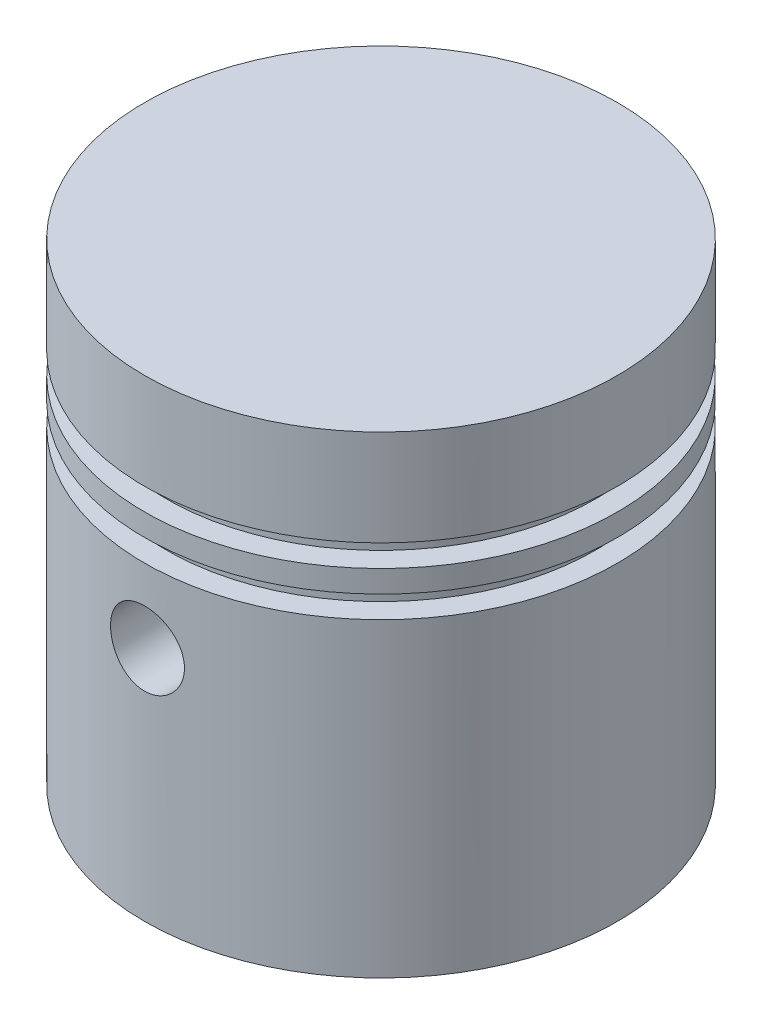
ISO-10303-21;
HEADER;
FILE_DESCRIPTION(('STEP AP214'),'2;1');
FILE_NAME('part.step','',(''),(''),'','','');
FILE_SCHEMA(('AUTOMOTIVE_DESIGN { 1 0 10303 214 1 1 1 1 }'));
ENDSEC;
DATA;
#1=APPLICATION_CONTEXT('core data for automotive mechanical design processes');
#2=APPLICATION_PROTOCOL_DEFINITION('international standard','automotive_design',2000,#1);
#3=PRODUCT_CONTEXT('',#1,'mechanical');
#4=PRODUCT('Part','Part','',(#3));
#5=PRODUCT_RELATED_PRODUCT_CATEGORY('part','',(#4));
#6=PRODUCT_DEFINITION_FORMATION('','',#4);
#7=PRODUCT_DEFINITION_CONTEXT('part definition',#1,'design');
#8=PRODUCT_DEFINITION('design','',#6,#7);
#9=PRODUCT_DEFINITION_SHAPE('','',#8);
#10=(LENGTH_UNIT() NAMED_UNIT(*) SI_UNIT(.MILLI.,.METRE.));
#11=(NAMED_UNIT(*) PLANE_ANGLE_UNIT() SI_UNIT($,.RADIAN.));
#12=(NAMED_UNIT(*) SI_UNIT($,.STERADIAN.) SOLID_ANGLE_UNIT());
#13=UNCERTAINTY_MEASURE_WITH_UNIT(LENGTH_MEASURE(1.E-05),#10,'distance_accuracy_value','');
#14=(GEOMETRIC_REPRESENTATION_CONTEXT(3) GLOBAL_UNCERTAINTY_ASSIGNED_CONTEXT((#13)) GLOBAL_UNIT_ASSIGNED_CONTEXT((#10,
#11,#12)) REPRESENTATION_CONTEXT('',''));
#15=CARTESIAN_POINT('',(0.,0.,0.));
#16=DIRECTION('',(0.,0.,1.));
#17=DIRECTION('',(1.,0.,0.));
#18=AXIS2_PLACEMENT_3D('',#15,#16,#17);
#19=CARTESIAN_POINT('',(0.,16.,0.));
#20=DIRECTION('',(0.,-1.,0.));
#21=DIRECTION('',(0.,0.,-1.));
#22=AXIS2_PLACEMENT_3D('',#19,#20,#21);
#23=CYLINDRICAL_SURFACE('',#22,8.);
#24=CARTESIAN_POINT('',(0.,10.5,0.));
#25=DIRECTION('',(0.,-1.,0.));
#26=DIRECTION('',(0.,0.,-1.));
#27=AXIS2_PLACEMENT_3D('',#24,#25,#26);
#28=CIRCLE('',#27,8.);
#29=CARTESIAN_POINT('',(0.,10.5,-8.));
#30=VERTEX_POINT('',#29);
#31=EDGE_CURVE('E93',#30,#30,#28,.T.);
#32=ORIENTED_EDGE('',*,*,#31,.T.);
#33=EDGE_LOOP('',(#32));
#34=FACE_BOUND('',#33,.T.);
#35=CARTESIAN_POINT('',(0.,9.25,-8.));
#36=CARTESIAN_POINT('',(-0.0697575486355164,9.24999715086424,-7.99999885097242));
#37=CARTESIAN_POINT('',(-0.139554702432852,9.24414094311322,-7.9990780624287));
#38=CARTESIAN_POINT('',(-0.277195657489051,9.22087815436162,-7.99549349048796));
#39=CARTESIAN_POINT('',(-0.345037530661658,9.20346055374825,-7.99282804422361));
#40=CARTESIAN_POINT('',(-0.476756269023702,9.15761016859669,-7.98605348582888));
#41=CARTESIAN_POINT('',(-0.540636176144951,9.1291859593192,-7.98194549781586));
#42=CARTESIAN_POINT('',(-0.662710625522299,9.0621507274292,-7.97273897019077));
#43=CARTESIAN_POINT('',(-0.720905905184154,9.02354102848203,-7.96764055931276));
#44=CARTESIAN_POINT('',(-0.830459955825808,8.93688347582302,-7.95697134207178));
#45=CARTESIAN_POINT('',(-0.881763739571321,8.88876650255488,-7.95139725696168));
#46=CARTESIAN_POINT('',(-0.975603844114116,8.78460902586555,-7.94043038065143));
#47=CARTESIAN_POINT('',(-1.01813964327096,8.7285680513499,-7.93503760025374));
#48=CARTESIAN_POINT('',(-1.09345272164442,8.60978086432814,-7.92501214063723));
#49=CARTESIAN_POINT('',(-1.12617636778996,8.5470002588191,-7.92038369893052));
#50=CARTESIAN_POINT('',(-1.18059340798533,8.4167492945711,-7.91245600871182));
#51=CARTESIAN_POINT('',(-1.20228745505032,8.34927921374472,-7.90915668151108));
#52=CARTESIAN_POINT('',(-1.23385779661084,8.21214454942811,-7.90429317255518));
#53=CARTESIAN_POINT('',(-1.24382852743748,8.1425022070906,-7.90271513266182));
#54=CARTESIAN_POINT('',(-1.25196184878811,8.00251640555368,-7.90143085535887));
#55=CARTESIAN_POINT('',(-1.25012517430233,7.93217299026698,-7.90172450144011));
#56=CARTESIAN_POINT('',(-1.23477290404445,7.79345148407366,-7.90413775227603));
#57=CARTESIAN_POINT('',(-1.22136281479847,7.72506138832343,-7.90624086092473));
#58=CARTESIAN_POINT('',(-1.18340968916876,7.59151399682034,-7.91201028172736));
#59=CARTESIAN_POINT('',(-1.15886631342066,7.52635679967973,-7.91567664153206));
#60=CARTESIAN_POINT('',(-1.09923458474692,7.40080564366142,-7.92417753427311));
#61=CARTESIAN_POINT('',(-1.06410186157774,7.34043310411347,-7.92901696543622));
#62=CARTESIAN_POINT('',(-0.984320290733186,7.22640023215723,-7.93931523075049));
#63=CARTESIAN_POINT('',(-0.939670766265083,7.17274037755627,-7.94477410894106));
#64=CARTESIAN_POINT('',(-0.841545444111664,7.07304487668334,-7.95576893124448));
#65=CARTESIAN_POINT('',(-0.787979002802695,7.02709842086527,-7.96130506817796));
#66=CARTESIAN_POINT('',(-0.67384847368968,6.94483342718005,-7.97177562673913));
#67=CARTESIAN_POINT('',(-0.613284350340659,6.90851493822159,-7.97671004531012));
#68=CARTESIAN_POINT('',(-0.486797963528246,6.8465309632888,-7.98542699513518));
#69=CARTESIAN_POINT('',(-0.420872093120231,6.8208727207335,-7.98920874270967));
#70=CARTESIAN_POINT('',(-0.28557476734838,6.78101701627639,-7.99518780000339));
#71=CARTESIAN_POINT('',(-0.2162035653436,6.76681871296676,-7.99738522604488));
#72=CARTESIAN_POINT('',(-0.076754168381868,6.7504053617749,-7.99993255863639));
#73=CARTESIAN_POINT('',(-0.00669073075435153,6.74806776051191,-8.0003013589643));
#74=CARTESIAN_POINT('',(0.13282727320582,6.75511635266799,-7.99920143245634));
#75=CARTESIAN_POINT('',(0.202281859962577,6.76450215129455,-7.99773276749821));
#76=CARTESIAN_POINT('',(0.338236723132852,6.79462919384009,-7.99313461846611));
#77=CARTESIAN_POINT('',(0.404750631028021,6.81531037913387,-7.99001392107693));
#78=CARTESIAN_POINT('',(0.533367033928313,6.86737754719939,-7.98246037841779));
#79=CARTESIAN_POINT('',(0.595469306519703,6.89876406922134,-7.97802746705036));
#80=CARTESIAN_POINT('',(0.714036101125204,6.97163599556329,-7.96829486370472));
#81=CARTESIAN_POINT('',(0.770452561891863,7.01319871004524,-7.9629886433171));
#82=CARTESIAN_POINT('',(0.875553482539031,7.10513604295389,-7.95211940232218));
#83=CARTESIAN_POINT('',(0.924237452235089,7.15551121960243,-7.94655636546338));
#84=CARTESIAN_POINT('',(1.01294040388345,7.2641905986086,-7.93574013768325));
#85=CARTESIAN_POINT('',(1.05287699292063,7.32256242356116,-7.93049020595401));
#86=CARTESIAN_POINT('',(1.1223778386332,7.44525803683067,-7.92095346402914));
#87=CARTESIAN_POINT('',(1.15194239389052,7.50958165374474,-7.91666662610998));
#88=CARTESIAN_POINT('',(1.19973385972497,7.64211482035709,-7.90956535676178));
#89=CARTESIAN_POINT('',(1.21800327473956,7.71030873438281,-7.9067454117448));
#90=CARTESIAN_POINT('',(1.24282061020268,7.84884457183199,-7.90288285140397));
#91=CARTESIAN_POINT('',(1.24936941542499,7.9191863327095,-7.9018401019222));
#92=CARTESIAN_POINT('',(1.25053726345378,8.05919935795374,-7.90165529022442));
#93=CARTESIAN_POINT('',(1.24528590274213,8.12886954846675,-7.90249258021451));
#94=CARTESIAN_POINT('',(1.2232811162795,8.26632264857215,-7.90592849470915));
#95=CARTESIAN_POINT('',(1.20652771543481,8.33410556225086,-7.90852711539975));
#96=CARTESIAN_POINT('',(1.16204164945926,8.46581891332026,-7.91518544427453));
#97=CARTESIAN_POINT('',(1.1343188086929,8.52975273912921,-7.91924384476704));
#98=CARTESIAN_POINT('',(1.06869384273209,8.65208280683814,-7.92836592023698));
#99=CARTESIAN_POINT('',(1.03079131410443,8.71047882914422,-7.93342963505413));
#100=CARTESIAN_POINT('',(0.945415040695399,8.82073277206341,-7.9440578404613));
#101=CARTESIAN_POINT('',(0.897845535473842,8.87251609830692,-7.94962700580145));
#102=CARTESIAN_POINT('',(0.794687973191021,8.96741061819337,-7.96060021820367));
#103=CARTESIAN_POINT('',(0.739098060392163,9.01051979929594,-7.96600422670061));
#104=CARTESIAN_POINT('',(0.621083429421708,9.08707561151578,-7.9760755122835));
#105=CARTESIAN_POINT('',(0.558619686071192,9.12046268637981,-7.98073817215134));
#106=CARTESIAN_POINT('',(0.428925941178893,9.17622049809647,-7.9887562991944));
#107=CARTESIAN_POINT('',(0.361700888290882,9.19860248627919,-7.9921131007106));
#108=CARTESIAN_POINT('',(0.245157119955798,9.22671651054529,-7.9963872293244));
#109=CARTESIAN_POINT('',(0.196552787825813,9.2354342453145,-7.99773495813061));
#110=CARTESIAN_POINT('',(0.098638898925291,9.24707695668954,-7.99954174348811));
#111=CARTESIAN_POINT('',(0.0493293520845593,9.25000201477867,-8.00000081253982));
#112=CARTESIAN_POINT('',(0.,9.25,-8.));
#113=B_SPLINE_CURVE_WITH_KNOTS('',3,(#35,#36,#37,#38,#39,#40,#41,#42,#43,#44,#45,#46,#47,#48,
#49,#50,#51,#52,#53,#54,#55,#56,#57,#58,#59,#60,#61,#62,#63,#64,#65,#66,#67,#68,#69,#70,#71,#72,
#73,#74,#75,#76,#77,#78,#79,#80,#81,#82,#83,#84,#85,#86,#87,#88,#89,#90,#91,#92,#93,#94,#95,#96,
#97,#98,#99,#100,#101,#102,#103,#104,#105,#106,#107,#108,#109,#110,#111,#112),.UNSPECIFIED.,.T.,
.F.,(4,2,2,2,2,2,2,2,2,2,2,2,2,2,2,2,2,2,2,2,2,2,2,2,2,2,2,2,2,2,2,2,2,2,2,2,2,2,4),(0.,
0.209092370238745,0.418384321264007,0.627513539720513,0.836615593960149,1.04729784076099,
1.25799261822711,1.46981889302879,1.68163262504619,1.89172815567497,2.10181060835273,
2.3099978801129,2.51819149825525,2.72726988701174,2.93636314946034,3.14772866167183,
3.35909524756913,3.57060521877282,3.78209965914933,3.99140427002957,4.20070183264178,
4.40889722378283,4.61710310371015,4.82694270734836,5.03679560800708,5.24854740124795,
5.4602930982449,5.67123705197565,5.88216508114648,6.09078790799346,6.29941028309448,
6.50784623483309,6.71629044835674,6.9269100615777,7.1375784857115,7.34951152099921,
7.5612274282814,7.7090900817577,7.85695065529354),.UNSPECIFIED.);
#114=CARTESIAN_POINT('',(0.,9.25,-8.));
#115=VERTEX_POINT('',#114);
#116=EDGE_CURVE('E92',#115,#115,#113,.T.);
#117=ORIENTED_EDGE('',*,*,#116,.T.);
#118=EDGE_LOOP('',(#117));
#119=FACE_BOUND('',#118,.T.);
#120=CARTESIAN_POINT('',(1.25,8.,7.90174031463955));
#121=CARTESIAN_POINT('',(1.24999714589602,7.93024831083641,7.90174151747695));
#122=CARTESIAN_POINT('',(1.24414188871431,7.86045700117776,7.90267390208986));
#123=CARTESIAN_POINT('',(1.2208832182291,7.72282818551743,7.90629985526833));
#124=CARTESIAN_POINT('',(1.20346876400912,7.65499261226406,7.90899510762377));
#125=CARTESIAN_POINT('',(1.15762758023421,7.52328720517116,7.91583424559868));
#126=CARTESIAN_POINT('',(1.12920957460922,7.45941427606284,7.919976983357));
#127=CARTESIAN_POINT('',(1.06218895908233,7.33735155458073,7.92924294913634));
#128=CARTESIAN_POINT('',(1.02358765802571,7.27916103317071,7.93436605112924));
#129=CARTESIAN_POINT('',(0.936938650554447,7.16960175742388,7.94506519257156));
#130=CARTESIAN_POINT('',(0.888819943087469,7.11828946280005,7.95064443921898));
#131=CARTESIAN_POINT('',(0.784655404938386,7.02443288978516,7.96159865413737));
#132=CARTESIAN_POINT('',(0.728609126584249,6.98188910688789,7.96697361085027));
#133=CARTESIAN_POINT('',(0.609817145928798,6.90656756147939,7.97694733576469));
#134=CARTESIAN_POINT('',(0.547037963178642,6.87384199801276,7.98154190081689));
#135=CARTESIAN_POINT('',(0.416790085897379,6.81942102263747,7.98940157455279));
#136=CARTESIAN_POINT('',(0.349321660068405,6.79772497930867,7.99266675933898));
#137=CARTESIAN_POINT('',(0.212192662724404,6.76615064052192,7.99747714289859));
#138=CARTESIAN_POINT('',(0.142554380080375,6.75617767546582,7.99903611302523));
#139=CARTESIAN_POINT('',(0.00257657177533495,6.74803847834832,8.00030565490477));
#140=CARTESIAN_POINT('',(-0.0677629114945939,6.74987153682408,8.00001633772735));
#141=CARTESIAN_POINT('',(-0.206500044861076,6.76521796313893,7.99763286949342));
#142=CARTESIAN_POINT('',(-0.274909271287588,6.77862946942016,7.99555445847991));
#143=CARTESIAN_POINT('',(-0.408494187671746,6.81659201431131,7.98984386977642));
#144=CARTESIAN_POINT('',(-0.473669788676088,6.84114335917707,7.98621164936935));
#145=CARTESIAN_POINT('',(-0.599243713396236,6.90079182793003,7.97777459210141));
#146=CARTESIAN_POINT('',(-0.659621495359185,6.93593150271398,7.97296503885208));
#147=CARTESIAN_POINT('',(-0.773661928266066,7.01572804031462,7.96270873510231));
#148=CARTESIAN_POINT('',(-0.827324099796619,7.06038558197749,7.95726193916408));
#149=CARTESIAN_POINT('',(-0.927010992600116,7.15851674353663,7.94626939127781));
#150=CARTESIAN_POINT('',(-0.972948128065373,7.21207933319743,7.94072320355105));
#151=CARTESIAN_POINT('',(-1.05519613023743,7.32619878234107,7.93021346922373));
#152=CARTESIAN_POINT('',(-1.09150692769168,7.38675569213703,7.92524992681491));
#153=CARTESIAN_POINT('',(-1.15348530317843,7.5132398140529,7.91646746408067));
#154=CARTESIAN_POINT('',(-1.1791433194208,7.57917178753673,7.91264957292446));
#155=CARTESIAN_POINT('',(-1.21899671563834,7.71448242435274,7.9066084495474));
#156=CARTESIAN_POINT('',(-1.23319297597629,7.78386082253486,7.90438509485371));
#157=CARTESIAN_POINT('',(-1.24959859618928,7.92331405163761,7.90180818484429));
#158=CARTESIAN_POINT('',(-1.25193236705635,7.99337390009738,7.90143522402998));
#159=CARTESIAN_POINT('',(-1.24487739516592,8.13288381764895,7.9025497488591));
#160=CARTESIAN_POINT('',(-1.23548904827164,8.20233390725293,7.90403717167621));
#161=CARTESIAN_POINT('',(-1.20536206277948,8.33826390373324,7.90868700525928));
#162=CARTESIAN_POINT('',(-1.18468589390989,8.4047579993198,7.91184019416676));
#163=CARTESIAN_POINT('',(-1.13263536120966,8.53333698555194,7.91945862198424));
#164=CARTESIAN_POINT('',(-1.10126042801475,8.59542164132451,7.92392393072055));
#165=CARTESIAN_POINT('',(-1.02840599585147,8.71397564082441,7.93370896103555));
#166=CARTESIAN_POINT('',(-0.986846255467355,8.77039511444998,7.93903534729881));
#167=CARTESIAN_POINT('',(-0.894912969976413,8.8755034904241,7.94992252348104));
#168=CARTESIAN_POINT('',(-0.844538882607102,8.92419191680352,7.95548332780552));
#169=CARTESIAN_POINT('',(-0.73585773382904,9.01290563531773,7.96627369437276));
#170=CARTESIAN_POINT('',(-0.677482820794917,9.05284828821503,7.97149979210822));
#171=CARTESIAN_POINT('',(-0.554779305146685,9.12235975999512,7.98097744670418));
#172=CARTESIAN_POINT('',(-0.490450876581244,9.15192888202297,7.98522903204154));
#173=CARTESIAN_POINT('',(-0.357919831889161,9.19972313764208,7.99226348838417));
#174=CARTESIAN_POINT('',(-0.289733573808541,9.2179927487197,7.9950521112786));
#175=CARTESIAN_POINT('',(-0.151213974885371,9.24281306633641,7.99887064894726));
#176=CARTESIAN_POINT('',(-0.0808807888272152,9.24936461567798,7.99990069020438));
#177=CARTESIAN_POINT('',(0.0591360825941384,9.25054092632761,8.00008455063986));
#178=CARTESIAN_POINT('',(0.128818714429901,9.24529187232137,7.99925822019994));
#179=CARTESIAN_POINT('',(0.266297297732436,9.22328734190984,7.9958623900713));
#180=CARTESIAN_POINT('',(0.334093256790798,9.20653191181083,7.99329289739778));
#181=CARTESIAN_POINT('',(0.465834425214725,9.16203637014377,7.98669820710743));
#182=CARTESIAN_POINT('',(0.529782898258215,9.13430572420936,7.98267426414775));
#183=CARTESIAN_POINT('',(0.652139036266007,9.06866058073917,7.97361166155728));
#184=CARTESIAN_POINT('',(0.710546490726961,9.03074569651356,7.96857296339862));
#185=CARTESIAN_POINT('',(0.820801095929352,8.94535527839514,7.9579764111196));
#186=CARTESIAN_POINT('',(0.872575847413248,8.89778684284548,7.95241381770964));
#187=CARTESIAN_POINT('',(0.96745356368349,8.7946350213348,7.94143064388637));
#188=CARTESIAN_POINT('',(1.01055449281041,8.739049759147,7.936010097069));
#189=CARTESIAN_POINT('',(1.08710075771188,8.62103944785431,7.92588898732018));
#190=CARTESIAN_POINT('',(1.12048522074144,8.55857452066291,7.92119304654734));
#191=CARTESIAN_POINT('',(1.17623782803743,8.42887839115245,7.91310716729583));
#192=CARTESIAN_POINT('',(1.19861725029602,8.36165214943308,7.90971589257156));
#193=CARTESIAN_POINT('',(1.22672453478634,8.24511513015645,7.90539548341694));
#194=CARTESIAN_POINT('',(1.23543924637686,8.19651920000936,7.90403218990729));
#195=CARTESIAN_POINT('',(1.24707794539411,8.09862210947502,7.90220418687746));
#196=CARTESIAN_POINT('',(1.25000201811811,8.04932095948656,7.90173946412116));
#197=CARTESIAN_POINT('',(1.25,8.,7.90174031463955));
#198=B_SPLINE_CURVE_WITH_KNOTS('',3,(#120,#121,#122,#123,#124,#125,#126,#127,#128,#129,#130,
#131,#132,#133,#134,#135,#136,#137,#138,#139,#140,#141,#142,#143,#144,#145,#146,#147,#148,#149,
#150,#151,#152,#153,#154,#155,#156,#157,#158,#159,#160,#161,#162,#163,#164,#165,#166,#167,#168,
#169,#170,#171,#172,#173,#174,#175,#176,#177,#178,#179,#180,#181,#182,#183,#184,#185,#186,#187,
#188,#189,#190,#191,#192,#193,#194,#195,#196,#197),.UNSPECIFIED.,.T.,.F.,(4,2,2,2,2,2,2,2,2,2,2,
2,2,2,2,2,2,2,2,2,2,2,2,2,2,2,2,2,2,2,2,2,2,2,2,2,2,2,4),(0.,0.209074763941293,0.41834951626796,
0.627458688206188,0.836540996707036,1.04724629023635,1.25796348710333,1.4697818900924,
1.68158816549379,1.89167198756851,2.10174318513255,2.30998489573485,2.5182323316538,
2.72732806463509,2.93643871601874,3.14778021695736,3.3591232382602,3.57065555017417,
3.78217161301618,3.99146470015321,4.20075071952324,4.40889006724113,4.61704049339771,
4.82688676416582,5.03674594931015,5.24850985997734,5.46026758176487,5.67118638114213,
5.88209000991818,6.09074917034593,6.29940749105005,6.50788624405681,6.71637291400441,
6.92697020198998,7.1376168575629,7.34955610829278,7.56127770816942,7.70911527287132,
7.85695065988004),.UNSPECIFIED.);
#199=CARTESIAN_POINT('',(1.25,8.,7.90174031463955));
#200=VERTEX_POINT('',#199);
#201=EDGE_CURVE('E86',#200,#200,#198,.T.);
#202=ORIENTED_EDGE('',*,*,#201,.T.);
#203=EDGE_LOOP('',(#202));
#204=FACE_BOUND('',#203,.T.);
#205=CARTESIAN_POINT('',(0.,0.,0.));
#206=DIRECTION('',(0.,1.,0.));
#207=DIRECTION('',(0.,0.,1.));
#208=AXIS2_PLACEMENT_3D('',#205,#206,#207);
#209=CIRCLE('',#208,8.);
#210=CARTESIAN_POINT('',(0.,0.,8.));
#211=VERTEX_POINT('',#210);
#212=EDGE_CURVE('E47',#211,#211,#209,.T.);
#213=ORIENTED_EDGE('',*,*,#212,.T.);
#214=EDGE_LOOP('',(#213));
#215=FACE_BOUND('',#214,.T.);
#216=ADVANCED_FACE('F34',(#34,#119,#204,#215),#23,.T.);
#217=CARTESIAN_POINT('',(0.,0.,0.));
#218=DIRECTION('',(0.,1.,0.));
#219=DIRECTION('',(0.,0.,1.));
#220=AXIS2_PLACEMENT_3D('',#217,#218,#219);
#221=PLANE('',#220);
#222=CARTESIAN_POINT('',(0.,0.,0.));
#223=DIRECTION('',(0.,-1.,0.));
#224=DIRECTION('',(0.,0.,-1.));
#225=AXIS2_PLACEMENT_3D('',#222,#223,#224);
#226=CIRCLE('',#225,6.5);
#227=CARTESIAN_POINT('',(0.,0.,-6.5));
#228=VERTEX_POINT('',#227);
#229=EDGE_CURVE('E55',#228,#228,#226,.T.);
#230=ORIENTED_EDGE('',*,*,#229,.F.);
#231=EDGE_LOOP('',(#230));
#232=FACE_BOUND('',#231,.T.);
#233=ORIENTED_EDGE('',*,*,#212,.F.);
#234=EDGE_LOOP('',(#233));
#235=FACE_BOUND('',#234,.T.);
#236=ADVANCED_FACE('F109',(#232,#235),#221,.F.);
#237=CARTESIAN_POINT('',(0.,5.,0.));
#238=DIRECTION('',(0.,-1.,0.));
#239=DIRECTION('',(0.,0.,-1.));
#240=AXIS2_PLACEMENT_3D('',#237,#238,#239);
#241=CYLINDRICAL_SURFACE('',#240,6.5);
#242=CARTESIAN_POINT('',(0.,5.,0.));
#243=DIRECTION('',(0.,-1.,0.));
#244=DIRECTION('',(0.,0.,-1.));
#245=AXIS2_PLACEMENT_3D('',#242,#243,#244);
#246=CIRCLE('',#245,6.5);
#247=CARTESIAN_POINT('',(0.,5.,-6.5));
#248=VERTEX_POINT('',#247);
#249=EDGE_CURVE('E52',#248,#248,#246,.T.);
#250=ORIENTED_EDGE('',*,*,#249,.F.);
#251=EDGE_LOOP('',(#250));
#252=FACE_BOUND('',#251,.T.);
#253=ORIENTED_EDGE('',*,*,#229,.T.);
#254=EDGE_LOOP('',(#253));
#255=FACE_BOUND('',#254,.T.);
#256=ADVANCED_FACE('F107',(#252,#255),#241,.F.);
#257=CARTESIAN_POINT('',(0.,5.,0.));
#258=DIRECTION('',(0.,-1.,0.));
#259=DIRECTION('',(0.,0.,-1.));
#260=AXIS2_PLACEMENT_3D('',#257,#258,#259);
#261=PLANE('',#260);
#262=CARTESIAN_POINT('',(0.,5.,0.));
#263=DIRECTION('',(0.,-1.,0.));
#264=DIRECTION('',(0.,0.,-1.));
#265=AXIS2_PLACEMENT_3D('',#262,#263,#264);
#266=CIRCLE('',#265,5.);
#267=CARTESIAN_POINT('',(0.,5.,-5.));
#268=VERTEX_POINT('',#267);
#269=EDGE_CURVE('E58',#268,#268,#266,.T.);
#270=ORIENTED_EDGE('',*,*,#269,.F.);
#271=EDGE_LOOP('',(#270));
#272=FACE_BOUND('',#271,.T.);
#273=ORIENTED_EDGE('',*,*,#249,.T.);
#274=EDGE_LOOP('',(#273));
#275=FACE_BOUND('',#274,.T.);
#276=ADVANCED_FACE('F246',(#272,#275),#261,.T.);
#277=CARTESIAN_POINT('',(0.,12.,0.));
#278=DIRECTION('',(0.,-1.,0.));
#279=DIRECTION('',(0.,0.,-1.));
#280=AXIS2_PLACEMENT_3D('',#277,#278,#279);
#281=CYLINDRICAL_SURFACE('',#280,5.);
#282=CARTESIAN_POINT('',(0.,9.25,-5.));
#283=CARTESIAN_POINT('',(0.0690634072247759,9.24999806188487,-4.99999883223344));
#284=CARTESIAN_POINT('',(0.138148464858969,9.24425704102184,-4.99855481776523));
#285=CARTESIAN_POINT('',(0.27433860314211,9.2214790405775,-4.99293428191577));
#286=CARTESIAN_POINT('',(0.341442539058949,9.20443565871846,-4.98875621183307));
#287=CARTESIAN_POINT('',(0.471684060152148,9.15963395544826,-4.97813021943366));
#288=CARTESIAN_POINT('',(0.534826302858336,9.1318885010706,-4.97168502368406));
#289=CARTESIAN_POINT('',(0.655560109920356,9.06651550829597,-4.95721119839661));
#290=CARTESIAN_POINT('',(0.7131514869573,9.02888763656755,-4.94918251545042));
#291=CARTESIAN_POINT('',(0.822334939417433,8.94399934195483,-4.93222844659834));
#292=CARTESIAN_POINT('',(0.873796408384227,8.89657368753402,-4.92328922623777));
#293=CARTESIAN_POINT('',(0.968124106002753,8.79378982924257,-4.90561350097941));
#294=CARTESIAN_POINT('',(1.01098936412428,8.73843073087792,-4.89687701906957));
#295=CARTESIAN_POINT('',(1.08752211899919,8.62033731105214,-4.88045646416425));
#296=CARTESIAN_POINT('',(1.12104351327113,8.55750564099133,-4.87278995392171));
#297=CARTESIAN_POINT('',(1.17699742379211,8.42687632361803,-4.85957912343519));
#298=CARTESIAN_POINT('',(1.19943171286611,8.35907947222853,-4.85403446393991));
#299=CARTESIAN_POINT('',(1.23212903067024,8.2218804181646,-4.84583730597959));
#300=CARTESIAN_POINT('',(1.24262689027778,8.15253758662517,-4.84312909229522));
#301=CARTESIAN_POINT('',(1.25188481255654,8.01302619248834,-4.84074468781451));
#302=CARTESIAN_POINT('',(1.25064678484831,7.94285776608449,-4.8410680037387));
#303=CARTESIAN_POINT('',(1.2366554371994,7.8054868268796,-4.84466004580515));
#304=CARTESIAN_POINT('',(1.22418195015877,7.73825364877908,-4.84785719168233));
#305=CARTESIAN_POINT('',(1.18852015575259,7.60686579090726,-4.85672258063736));
#306=CARTESIAN_POINT('',(1.16533108505785,7.54271133080918,-4.8623909997558));
#307=CARTESIAN_POINT('',(1.10865789828096,7.41855165312328,-4.87562594920155));
#308=CARTESIAN_POINT('',(1.07507222269409,7.35859485684204,-4.88321106224518));
#309=CARTESIAN_POINT('',(0.998630230012462,7.2450677418693,-4.89941425705322));
#310=CARTESIAN_POINT('',(0.955772290674033,7.19149854327729,-4.90803251945613));
#311=CARTESIAN_POINT('',(0.860552853901015,7.090663653588,-4.92563233783151));
#312=CARTESIAN_POINT('',(0.807955215138217,7.04362125828221,-4.93461724564976));
#313=CARTESIAN_POINT('',(0.695509931253083,6.95898229794675,-4.95171637982321));
#314=CARTESIAN_POINT('',(0.63566206475662,6.92138602144703,-4.95983057957846));
#315=CARTESIAN_POINT('',(0.51009657390116,6.85662451147968,-4.97431443411819));
#316=CARTESIAN_POINT('',(0.44435949434052,6.82949554978798,-4.98067800106438));
#317=CARTESIAN_POINT('',(0.309063340119069,6.78673557857536,-4.99089930826182));
#318=CARTESIAN_POINT('',(0.239504999292071,6.77110236965155,-4.99475752782734));
#319=CARTESIAN_POINT('',(0.100449975325023,6.75211869536764,-4.99946249392812));
#320=CARTESIAN_POINT('',(0.0309972666568417,6.74846414493725,-5.00038377923565));
#321=CARTESIAN_POINT('',(-0.107527395667923,6.75270750171291,-4.99932337345376));
#322=CARTESIAN_POINT('',(-0.176599383037162,6.76060436899928,-4.99734194368205));
#323=CARTESIAN_POINT('',(-0.311345223980409,6.78747575699282,-4.99074650939464));
#324=CARTESIAN_POINT('',(-0.377054265807295,6.80628438623082,-4.98617195154843));
#325=CARTESIAN_POINT('',(-0.504381077043759,6.85425590335704,-4.97490588861778));
#326=CARTESIAN_POINT('',(-0.565998432527195,6.88341983692764,-4.9682141697491));
#327=CARTESIAN_POINT('',(-0.684602612024873,6.95186344072894,-4.95327756605259));
#328=CARTESIAN_POINT('',(-0.741487868196525,6.9913134269973,-4.94500722805777));
#329=CARTESIAN_POINT('',(-0.847938844702705,7.07899159066414,-4.92787090989516));
#330=CARTESIAN_POINT('',(-0.897503299144173,7.12722128301409,-4.91900482709754));
#331=CARTESIAN_POINT('',(-0.989158806727275,7.23250163403705,-4.90140797467309));
#332=CARTESIAN_POINT('',(-1.03103655635169,7.28973975250202,-4.89268586822734));
#333=CARTESIAN_POINT('',(-1.10459229917725,7.41061052872143,-4.87660731981032));
#334=CARTESIAN_POINT('',(-1.13627074513161,7.47424290246646,-4.86925081722522));
#335=CARTESIAN_POINT('',(-1.18829285050774,7.60575476867757,-4.85681745612221));
#336=CARTESIAN_POINT('',(-1.20870366387839,7.67360635695334,-4.85172712743255));
#337=CARTESIAN_POINT('',(-1.23778804996148,7.81192469824092,-4.84438953408486));
#338=CARTESIAN_POINT('',(-1.24646418956555,7.88239087586041,-4.84214164766613));
#339=CARTESIAN_POINT('',(-1.25169882527833,8.02176751987934,-4.84079084336631));
#340=CARTESIAN_POINT('',(-1.2485982481501,8.09066452927061,-4.8415994394022));
#341=CARTESIAN_POINT('',(-1.23114773192739,8.22691990722332,-4.84606590839869));
#342=CARTESIAN_POINT('',(-1.21679801890564,8.29427830667804,-4.84972372409881));
#343=CARTESIAN_POINT('',(-1.17744276620233,8.42517371588784,-4.85942717235602));
#344=CARTESIAN_POINT('',(-1.15250117056698,8.48873108770017,-4.86545846030258));
#345=CARTESIAN_POINT('',(-1.09272076133756,8.61080448559474,-4.8792312977069));
#346=CARTESIAN_POINT('',(-1.05788057502849,8.6693198109891,-4.88697308433977));
#347=CARTESIAN_POINT('',(-0.97822312386428,8.78129552416835,-4.90354695219593));
#348=CARTESIAN_POINT('',(-0.933169302426878,8.8345842278533,-4.91240220693131));
#349=CARTESIAN_POINT('',(-0.834824475991445,8.93295587066284,-4.93006689371905));
#350=CARTESIAN_POINT('',(-0.781531517717621,8.97803685842747,-4.93887631439216));
#351=CARTESIAN_POINT('',(-0.667056322252157,9.05950942380384,-4.95564713039719));
#352=CARTESIAN_POINT('',(-0.605748685263655,9.09572884472631,-4.9635902780489));
#353=CARTESIAN_POINT('',(-0.47772171625873,9.15728955245044,-4.97754104145932));
#354=CARTESIAN_POINT('',(-0.41100630286395,9.18263863387378,-4.98355004333151));
#355=CARTESIAN_POINT('',(-0.28700854436956,9.21797652527471,-4.99206716304618));
#356=CARTESIAN_POINT('',(-0.230316809090057,9.22995936921119,-4.99502154210576));
#357=CARTESIAN_POINT('',(-0.115755059613569,9.24597161968495,-4.9989883769329));
#358=CARTESIAN_POINT('',(-0.0578851343688469,9.25000162442108,-5.00000097875745));
#359=CARTESIAN_POINT('',(0.,9.25,-5.));
#360=B_SPLINE_CURVE_WITH_KNOTS('',3,(#282,#283,#284,#285,#286,#287,#288,#289,#290,#291,#292,
#293,#294,#295,#296,#297,#298,#299,#300,#301,#302,#303,#304,#305,#306,#307,#308,#309,#310,#311,
#312,#313,#314,#315,#316,#317,#318,#319,#320,#321,#322,#323,#324,#325,#326,#327,#328,#329,#330,
#331,#332,#333,#334,#335,#336,#337,#338,#339,#340,#341,#342,#343,#344,#345,#346,#347,#348,#349,
#350,#351,#352,#353,#354,#355,#356,#357,#358,#359),.UNSPECIFIED.,.T.,.F.,(4,2,2,2,2,2,2,2,2,2,2,
2,2,2,2,2,2,2,2,2,2,2,2,2,2,2,2,2,2,2,2,2,2,2,2,2,2,2,4),(0.,0.206978093726575,
0.414073531469916,0.620920751905089,0.827774950141106,1.03845362864282,1.24915607983385,
1.46298872954839,1.6767871764114,1.88630245916192,2.09578365093914,2.30018747505848,
2.50460586221699,2.71108773228233,2.91760575696802,3.13001250807516,3.34242574631872,
3.55556857507595,3.76867061407202,3.97631924124397,4.18394917593952,4.38850228761698,
4.59307606101909,4.80127989637793,5.00951969173349,5.2228709100373,5.4362126562459,
5.6482687884503,5.8602785271034,6.06619816998844,6.27211367463362,6.47680333799539,
6.68152140114084,6.89157980341592,7.10168808142015,7.3156015458299,7.52936136517791,
7.70285202451791,7.87632963369199),.UNSPECIFIED.);
#361=CARTESIAN_POINT('',(0.,9.25,-5.));
#362=VERTEX_POINT('',#361);
#363=EDGE_CURVE('E38',#362,#362,#360,.T.);
#364=ORIENTED_EDGE('',*,*,#363,.T.);
#365=EDGE_LOOP('',(#364));
#366=FACE_BOUND('',#365,.T.);
#367=CARTESIAN_POINT('',(1.25,8.,4.84122918275927));
#368=CARTESIAN_POINT('',(1.24999803929589,8.06902537546231,4.84123050042654));
#369=CARTESIAN_POINT('',(1.24426312274865,8.138072449339,4.84272153006957));
#370=CARTESIAN_POINT('',(1.22151156273207,8.27418378908702,4.84850930996624));
#371=CARTESIAN_POINT('',(1.2044883533711,8.34124687723416,4.85280769310907));
#372=CARTESIAN_POINT('',(1.15974559981597,8.47140176909352,4.86369362297984));
#373=CARTESIAN_POINT('',(1.13203986392723,8.53449857769283,4.87027821345204));
#374=CARTESIAN_POINT('',(1.06676057063071,8.65515542626996,4.88499096014404));
#375=CARTESIAN_POINT('',(1.02918659428035,8.71271523104011,4.89311918189251));
#376=CARTESIAN_POINT('',(0.944354213655938,8.8219308226311,4.91020358177806));
#377=CARTESIAN_POINT('',(0.896918443852025,8.87344680017502,4.91917298811515));
#378=CARTESIAN_POINT('',(0.794091032050333,8.96788069718017,4.93681437757649));
#379=CARTESIAN_POINT('',(0.738698647090154,9.01079781281087,4.94548633283195));
#380=CARTESIAN_POINT('',(0.620572600539478,9.08738773381564,4.96170207760291));
#381=CARTESIAN_POINT('',(0.557747288097561,9.12092319408073,4.96922843700296));
#382=CARTESIAN_POINT('',(0.427131592146382,9.17690482207654,4.98215405962992));
#383=CARTESIAN_POINT('',(0.35934194289597,9.19935262595776,4.98755363667172));
#384=CARTESIAN_POINT('',(0.22217937937708,9.23207391728929,4.9955237942409));
#385=CARTESIAN_POINT('',(0.152866359774487,9.24258482216329,4.99814946922157));
#386=CARTESIAN_POINT('',(0.0134144096313845,9.25187918963778,5.00046797053649));
#387=CARTESIAN_POINT('',(-0.0567243972690343,9.2506643861048,5.00016123048352));
#388=CARTESIAN_POINT('',(-0.194190308965484,9.23671257487493,4.99669047476767));
#389=CARTESIAN_POINT('',(-0.261545269501334,9.22423183747307,4.99359001170437));
#390=CARTESIAN_POINT('',(-0.393172809267108,9.18851436497575,4.98495418262427));
#391=CARTESIAN_POINT('',(-0.457445224213047,9.16527705731129,4.9794186869922));
#392=CARTESIAN_POINT('',(-0.581758379377258,9.10849871465647,4.96643754850448));
#393=CARTESIAN_POINT('',(-0.64175563720813,9.07486647766913,4.95897509847527));
#394=CARTESIAN_POINT('',(-0.755344527925611,8.99832216044187,4.94294951904824));
#395=CARTESIAN_POINT('',(-0.808935043856882,8.95540846571969,4.93438619826245));
#396=CARTESIAN_POINT('',(-0.909717543856195,8.86014562900881,4.9168185688476));
#397=CARTESIAN_POINT('',(-0.956697098843999,8.80757255382611,4.90780859762959));
#398=CARTESIAN_POINT('',(-1.04122046995377,8.69520001322988,4.89057521758353));
#399=CARTESIAN_POINT('',(-1.07876384505752,8.6354002102545,4.88235184552985));
#400=CARTESIAN_POINT('',(-1.14348516127825,8.50985498292552,4.86760248415824));
#401=CARTESIAN_POINT('',(-1.17061195871311,8.4440821348434,4.8610849186286));
#402=CARTESIAN_POINT('',(-1.21335702579543,8.30870726596177,4.85059320069978));
#403=CARTESIAN_POINT('',(-1.22897775819114,8.23910606800843,4.84661850405109));
#404=CARTESIAN_POINT('',(-1.24791481933259,8.10002024923844,4.8417767801957));
#405=CARTESIAN_POINT('',(-1.25154523695981,8.03058110333518,4.84083044546824));
#406=CARTESIAN_POINT('',(-1.24725849525777,7.89208903171092,4.8419367174052));
#407=CARTESIAN_POINT('',(-1.2393423989244,7.82303607102438,4.84398904800633));
#408=CARTESIAN_POINT('',(-1.21246273196883,7.68844286752265,4.8507854097728));
#409=CARTESIAN_POINT('',(-1.19368203414087,7.62286363671458,4.85548485117188));
#410=CARTESIAN_POINT('',(-1.14580904083531,7.49578427107416,4.86700359135481));
#411=CARTESIAN_POINT('',(-1.11671552385627,7.43428462047233,4.87382314124307));
#412=CARTESIAN_POINT('',(-1.04838533396828,7.31577936106633,4.88898068546631));
#413=CARTESIAN_POINT('',(-1.00896087691781,7.25888557997845,4.89734584303321));
#414=CARTESIAN_POINT('',(-0.92132536616807,7.15240581859932,4.91458541535858));
#415=CARTESIAN_POINT('',(-0.873112868506799,7.10282104167496,4.92345991364235));
#416=CARTESIAN_POINT('',(-0.767828401230908,7.01109447871452,4.94098701515803));
#417=CARTESIAN_POINT('',(-0.710564940664491,6.96916996872559,4.94962851030918));
#418=CARTESIAN_POINT('',(-0.589628353368345,6.89553206652438,4.96548608306867));
#419=CARTESIAN_POINT('',(-0.525955561196989,6.8638181416959,4.9727022350198));
#420=CARTESIAN_POINT('',(-0.394447752163863,6.81177698273603,4.98485057869157));
#421=CARTESIAN_POINT('',(-0.326646726284852,6.79136785781047,4.98979915011205));
#422=CARTESIAN_POINT('',(-0.18843720039851,6.76226983269579,4.99692646697894));
#423=CARTESIAN_POINT('',(-0.118029206301555,6.75357867063048,4.99910574696704));
#424=CARTESIAN_POINT('',(0.0213544080541576,6.74829051303058,5.00042711761014));
#425=CARTESIAN_POINT('',(0.0903172837075411,6.75137286363076,4.9996497360001));
#426=CARTESIAN_POINT('',(0.226709370518424,6.76880978411791,4.99532370571779));
#427=CARTESIAN_POINT('',(0.294138627226108,6.78316401876638,4.99177513946369));
#428=CARTESIAN_POINT('',(0.42521379455602,6.82256527471366,4.98231791067453));
#429=CARTESIAN_POINT('',(0.488878118226273,6.84755431664328,4.97642205628333));
#430=CARTESIAN_POINT('',(0.611146316301835,6.90746322377416,4.9628911114173));
#431=CARTESIAN_POINT('',(0.669749551581314,6.94238434083696,4.9552558017217));
#432=CARTESIAN_POINT('',(0.781752410529874,7.02214404249634,4.93884062101666));
#433=CARTESIAN_POINT('',(0.83499373537573,7.06720017863422,4.93003771182014));
#434=CARTESIAN_POINT('',(0.933268775339069,7.16552856496725,4.91238311316553));
#435=CARTESIAN_POINT('',(0.978300406335236,7.21880289512238,4.90353141190695));
#436=CARTESIAN_POINT('',(1.05970253309904,7.33325176775166,4.88659344825685));
#437=CARTESIAN_POINT('',(1.09589577430819,7.39455515426578,4.87852454662356));
#438=CARTESIAN_POINT('',(1.15740862076958,7.52256936240338,4.8642994443827));
#439=CARTESIAN_POINT('',(1.18273613719965,7.58927620763343,4.85814185308378));
#440=CARTESIAN_POINT('',(1.2180281607068,7.7132212647834,4.84939885924729));
#441=CARTESIAN_POINT('',(1.22999146324422,7.76986645547983,4.84635828750683));
#442=CARTESIAN_POINT('',(1.24597786571659,7.88433608624996,4.84227298231965));
#443=CARTESIAN_POINT('',(1.25000164296523,7.94216042530633,4.84122807862454));
#444=CARTESIAN_POINT('',(1.25,8.,4.84122918275927));
#445=B_SPLINE_CURVE_WITH_KNOTS('',3,(#367,#368,#369,#370,#371,#372,#373,#374,#375,#376,#377,
#378,#379,#380,#381,#382,#383,#384,#385,#386,#387,#388,#389,#390,#391,#392,#393,#394,#395,#396,
#397,#398,#399,#400,#401,#402,#403,#404,#405,#406,#407,#408,#409,#410,#411,#412,#413,#414,#415,
#416,#417,#418,#419,#420,#421,#422,#423,#424,#425,#426,#427,#428,#429,#430,#431,#432,#433,#434,
#435,#436,#437,#438,#439,#440,#441,#442,#443,#444),.UNSPECIFIED.,.T.,.F.,(4,2,2,2,2,2,2,2,2,2,2,
2,2,2,2,2,2,2,2,2,2,2,2,2,2,2,2,2,2,2,2,2,2,2,2,2,2,2,4),(0.,0.206863720868071,
0.413847870714333,0.620565363583007,0.827291633777391,1.03811977096488,1.24896760739933,
1.4627574819896,1.67651579923546,1.88594375497673,2.0953407433301,2.30009131344474,
2.50485278362393,2.71146437127222,2.91811192734457,3.13035233285956,3.34260265599901,
3.55588216004201,3.76911600064774,3.97671787380859,4.18430063591901,4.38848702504604,
4.59269760710709,4.80091422929579,5.00916509442522,5.22262665482659,5.43607707859777,
5.64796036403465,5.85980274454519,6.06591723063728,6.27202558688491,6.47702438279855,
6.68204902869036,6.89198548291035,7.10197515782754,7.31588238642339,7.5296336068331,
7.70298913588665,7.8763298754976),.UNSPECIFIED.);
#446=CARTESIAN_POINT('',(1.25,8.,4.84122918275927));
#447=VERTEX_POINT('',#446);
#448=EDGE_CURVE('E61',#447,#447,#445,.T.);
#449=ORIENTED_EDGE('',*,*,#448,.T.);
#450=EDGE_LOOP('',(#449));
#451=FACE_BOUND('',#450,.T.);
#452=ORIENTED_EDGE('',*,*,#269,.T.);
#453=EDGE_LOOP('',(#452));
#454=FACE_BOUND('',#453,.T.);
#455=CARTESIAN_POINT('',(0.,12.,0.));
#456=DIRECTION('',(0.,-1.,0.));
#457=DIRECTION('',(0.,0.,-1.));
#458=AXIS2_PLACEMENT_3D('',#455,#456,#457);
#459=CIRCLE('',#458,5.);
#460=CARTESIAN_POINT('',(0.,12.,-5.));
#461=VERTEX_POINT('',#460);
#462=EDGE_CURVE('E60',#461,#461,#459,.T.);
#463=ORIENTED_EDGE('',*,*,#462,.F.);
#464=EDGE_LOOP('',(#463));
#465=FACE_BOUND('',#464,.T.);
#466=ADVANCED_FACE('F67',(#366,#451,#454,#465),#281,.F.);
#467=CARTESIAN_POINT('',(0.,12.,0.));
#468=DIRECTION('',(0.,-1.,0.));
#469=DIRECTION('',(0.,0.,-1.));
#470=AXIS2_PLACEMENT_3D('',#467,#468,#469);
#471=PLANE('',#470);
#472=ORIENTED_EDGE('',*,*,#462,.T.);
#473=EDGE_LOOP('',(#472));
#474=FACE_BOUND('',#473,.T.);
#475=ADVANCED_FACE('F80',(#474),#471,.T.);
#476=CARTESIAN_POINT('',(0.,8.,-8.));
#477=DIRECTION('',(0.,0.,1.));
#478=DIRECTION('',(1.,0.,0.));
#479=AXIS2_PLACEMENT_3D('',#476,#477,#478);
#480=CYLINDRICAL_SURFACE('',#479,1.25);
#481=ORIENTED_EDGE('',*,*,#448,.F.);
#482=EDGE_LOOP('',(#481));
#483=FACE_BOUND('',#482,.T.);
#484=ORIENTED_EDGE('',*,*,#201,.F.);
#485=EDGE_LOOP('',(#484));
#486=FACE_BOUND('',#485,.T.);
#487=ADVANCED_FACE('F76',(#483,#486),#480,.F.);
#488=ORIENTED_EDGE('',*,*,#363,.F.);
#489=EDGE_LOOP('',(#488));
#490=FACE_BOUND('',#489,.T.);
#491=ORIENTED_EDGE('',*,*,#116,.F.);
#492=EDGE_LOOP('',(#491));
#493=FACE_BOUND('',#492,.T.);
#494=ADVANCED_FACE('F71',(#490,#493),#480,.F.);
#495=CARTESIAN_POINT('',(0.,11.25,0.));
#496=DIRECTION('',(0.,-1.,0.));
#497=DIRECTION('',(0.,0.,-1.));
#498=AXIS2_PLACEMENT_3D('',#495,#496,#497);
#499=PLANE('',#498);
#500=CARTESIAN_POINT('',(0.,11.25,0.));
#501=DIRECTION('',(0.,-1.,0.));
#502=DIRECTION('',(0.,0.,-1.));
#503=AXIS2_PLACEMENT_3D('',#500,#501,#502);
#504=CIRCLE('',#503,7.25);
#505=CARTESIAN_POINT('',(0.,11.25,-7.25));
#506=VERTEX_POINT('',#505);
#507=EDGE_CURVE('E145',#506,#506,#504,.T.);
#508=ORIENTED_EDGE('',*,*,#507,.F.);
#509=EDGE_LOOP('',(#508));
#510=FACE_BOUND('',#509,.T.);
#511=CARTESIAN_POINT('',(0.,11.25,0.));
#512=DIRECTION('',(0.,-1.,0.));
#513=DIRECTION('',(0.,0.,-1.));
#514=AXIS2_PLACEMENT_3D('',#511,#512,#513);
#515=CIRCLE('',#514,8.);
#516=CARTESIAN_POINT('',(0.,11.25,-8.));
#517=VERTEX_POINT('',#516);
#518=EDGE_CURVE('E66',#517,#517,#515,.T.);
#519=ORIENTED_EDGE('',*,*,#518,.T.);
#520=EDGE_LOOP('',(#519));
#521=FACE_BOUND('',#520,.T.);
#522=ADVANCED_FACE('F75',(#510,#521),#499,.T.);
#523=CARTESIAN_POINT('',(0.,10.5,0.));
#524=DIRECTION('',(0.,-1.,0.));
#525=DIRECTION('',(0.,0.,-1.));
#526=AXIS2_PLACEMENT_3D('',#523,#524,#525);
#527=PLANE('',#526);
#528=CARTESIAN_POINT('',(0.,10.5,0.));
#529=DIRECTION('',(0.,-1.,0.));
#530=DIRECTION('',(0.,0.,-1.));
#531=AXIS2_PLACEMENT_3D('',#528,#529,#530);
#532=CIRCLE('',#531,7.25);
#533=CARTESIAN_POINT('',(0.,10.5,-7.25));
#534=VERTEX_POINT('',#533);
#535=EDGE_CURVE('E147',#534,#534,#532,.T.);
#536=ORIENTED_EDGE('',*,*,#535,.T.);
#537=EDGE_LOOP('',(#536));
#538=FACE_BOUND('',#537,.T.);
#539=ORIENTED_EDGE('',*,*,#31,.F.);
#540=EDGE_LOOP('',(#539));
#541=FACE_BOUND('',#540,.T.);
#542=ADVANCED_FACE('F78',(#538,#541),#527,.F.);
#543=CARTESIAN_POINT('',(0.,11.25,0.));
#544=DIRECTION('',(0.,-1.,0.));
#545=DIRECTION('',(0.,0.,-1.));
#546=AXIS2_PLACEMENT_3D('',#543,#544,#545);
#547=CYLINDRICAL_SURFACE('',#546,7.25);
#548=ORIENTED_EDGE('',*,*,#507,.T.);
#549=EDGE_LOOP('',(#548));
#550=FACE_BOUND('',#549,.T.);
#551=ORIENTED_EDGE('',*,*,#535,.F.);
#552=EDGE_LOOP('',(#551));
#553=FACE_BOUND('',#552,.T.);
#554=ADVANCED_FACE('F127',(#550,#553),#547,.T.);
#555=CARTESIAN_POINT('',(0.,12.,0.));
#556=DIRECTION('',(0.,-1.,0.));
#557=DIRECTION('',(0.,0.,-1.));
#558=AXIS2_PLACEMENT_3D('',#555,#556,#557);
#559=CIRCLE('',#558,8.);
#560=CARTESIAN_POINT('',(0.,12.,-8.));
#561=VERTEX_POINT('',#560);
#562=EDGE_CURVE('E141',#561,#561,#559,.T.);
#563=ORIENTED_EDGE('',*,*,#562,.T.);
#564=EDGE_LOOP('',(#563));
#565=FACE_BOUND('',#564,.T.);
#566=ORIENTED_EDGE('',*,*,#518,.F.);
#567=EDGE_LOOP('',(#566));
#568=FACE_BOUND('',#567,.T.);
#569=ADVANCED_FACE('F117',(#565,#568),#23,.T.);
#570=CARTESIAN_POINT('',(0.,12.75,0.));
#571=DIRECTION('',(0.,-1.,0.));
#572=DIRECTION('',(0.,0.,-1.));
#573=AXIS2_PLACEMENT_3D('',#570,#571,#572);
#574=PLANE('',#573);
#575=CARTESIAN_POINT('',(0.,12.75,0.));
#576=DIRECTION('',(0.,-1.,0.));
#577=DIRECTION('',(0.,0.,-1.));
#578=AXIS2_PLACEMENT_3D('',#575,#576,#577);
#579=CIRCLE('',#578,7.25);
#580=CARTESIAN_POINT('',(0.,12.75,-7.25));
#581=VERTEX_POINT('',#580);
#582=EDGE_CURVE('E154',#581,#581,#579,.T.);
#583=ORIENTED_EDGE('',*,*,#582,.F.);
#584=EDGE_LOOP('',(#583));
#585=FACE_BOUND('',#584,.T.);
#586=CARTESIAN_POINT('',(0.,12.75,0.));
#587=DIRECTION('',(0.,-1.,0.));
#588=DIRECTION('',(0.,0.,-1.));
#589=AXIS2_PLACEMENT_3D('',#586,#587,#588);
#590=CIRCLE('',#589,8.);
#591=CARTESIAN_POINT('',(0.,12.75,-8.));
#592=VERTEX_POINT('',#591);
#593=EDGE_CURVE('E150',#592,#592,#590,.T.);
#594=ORIENTED_EDGE('',*,*,#593,.T.);
#595=EDGE_LOOP('',(#594));
#596=FACE_BOUND('',#595,.T.);
#597=ADVANCED_FACE('F126',(#585,#596),#574,.T.);
#598=CARTESIAN_POINT('',(0.,12.,0.));
#599=DIRECTION('',(0.,-1.,0.));
#600=DIRECTION('',(0.,0.,-1.));
#601=AXIS2_PLACEMENT_3D('',#598,#599,#600);
#602=PLANE('',#601);
#603=CARTESIAN_POINT('',(0.,12.,0.));
#604=DIRECTION('',(0.,-1.,0.));
#605=DIRECTION('',(0.,0.,-1.));
#606=AXIS2_PLACEMENT_3D('',#603,#604,#605);
#607=CIRCLE('',#606,7.25);
#608=CARTESIAN_POINT('',(0.,12.,-7.25));
#609=VERTEX_POINT('',#608);
#610=EDGE_CURVE('E157',#609,#609,#607,.T.);
#611=ORIENTED_EDGE('',*,*,#610,.T.);
#612=EDGE_LOOP('',(#611));
#613=FACE_BOUND('',#612,.T.);
#614=ORIENTED_EDGE('',*,*,#562,.F.);
#615=EDGE_LOOP('',(#614));
#616=FACE_BOUND('',#615,.T.);
#617=ADVANCED_FACE('F133',(#613,#616),#602,.F.);
#618=CARTESIAN_POINT('',(0.,12.75,0.));
#619=DIRECTION('',(0.,-1.,0.));
#620=DIRECTION('',(0.,0.,-1.));
#621=AXIS2_PLACEMENT_3D('',#618,#619,#620);
#622=CYLINDRICAL_SURFACE('',#621,7.25);
#623=ORIENTED_EDGE('',*,*,#582,.T.);
#624=EDGE_LOOP('',(#623));
#625=FACE_BOUND('',#624,.T.);
#626=ORIENTED_EDGE('',*,*,#610,.F.);
#627=EDGE_LOOP('',(#626));
#628=FACE_BOUND('',#627,.T.);
#629=ADVANCED_FACE('F163',(#625,#628),#622,.T.);
#630=CARTESIAN_POINT('',(0.,16.,0.));
#631=DIRECTION('',(0.,1.,0.));
#632=DIRECTION('',(0.,0.,1.));
#633=AXIS2_PLACEMENT_3D('',#630,#631,#632);
#634=PLANE('',#633);
#635=CARTESIAN_POINT('',(0.,16.,0.));
#636=DIRECTION('',(0.,1.,0.));
#637=DIRECTION('',(0.,0.,1.));
#638=AXIS2_PLACEMENT_3D('',#635,#636,#637);
#639=CIRCLE('',#638,8.);
#640=CARTESIAN_POINT('',(0.,16.,8.));
#641=VERTEX_POINT('',#640);
#642=EDGE_CURVE('E10',#641,#641,#639,.T.);
#643=ORIENTED_EDGE('',*,*,#642,.T.);
#644=EDGE_LOOP('',(#643));
#645=FACE_BOUND('',#644,.T.);
#646=ADVANCED_FACE('F123',(#645),#634,.T.);
#647=ORIENTED_EDGE('',*,*,#642,.F.);
#648=EDGE_LOOP('',(#647));
#649=FACE_BOUND('',#648,.T.);
#650=ORIENTED_EDGE('',*,*,#593,.F.);
#651=EDGE_LOOP('',(#650));
#652=FACE_BOUND('',#651,.T.);
#653=ADVANCED_FACE('F116',(#649,#652),#23,.T.);
#654=CLOSED_SHELL('',(#216,#236,#256,#276,#466,#475,#487,#494,#522,#542,#554,#569,#597,#617,
#629,#646,#653));
#655=MANIFOLD_SOLID_BREP('B2',#654);
#656=ADVANCED_BREP_SHAPE_REPRESENTATION('',(#18,#655),#14);
#657=SHAPE_DEFINITION_REPRESENTATION(#9,#656);
ENDSEC;
END-ISO-10303-21;
